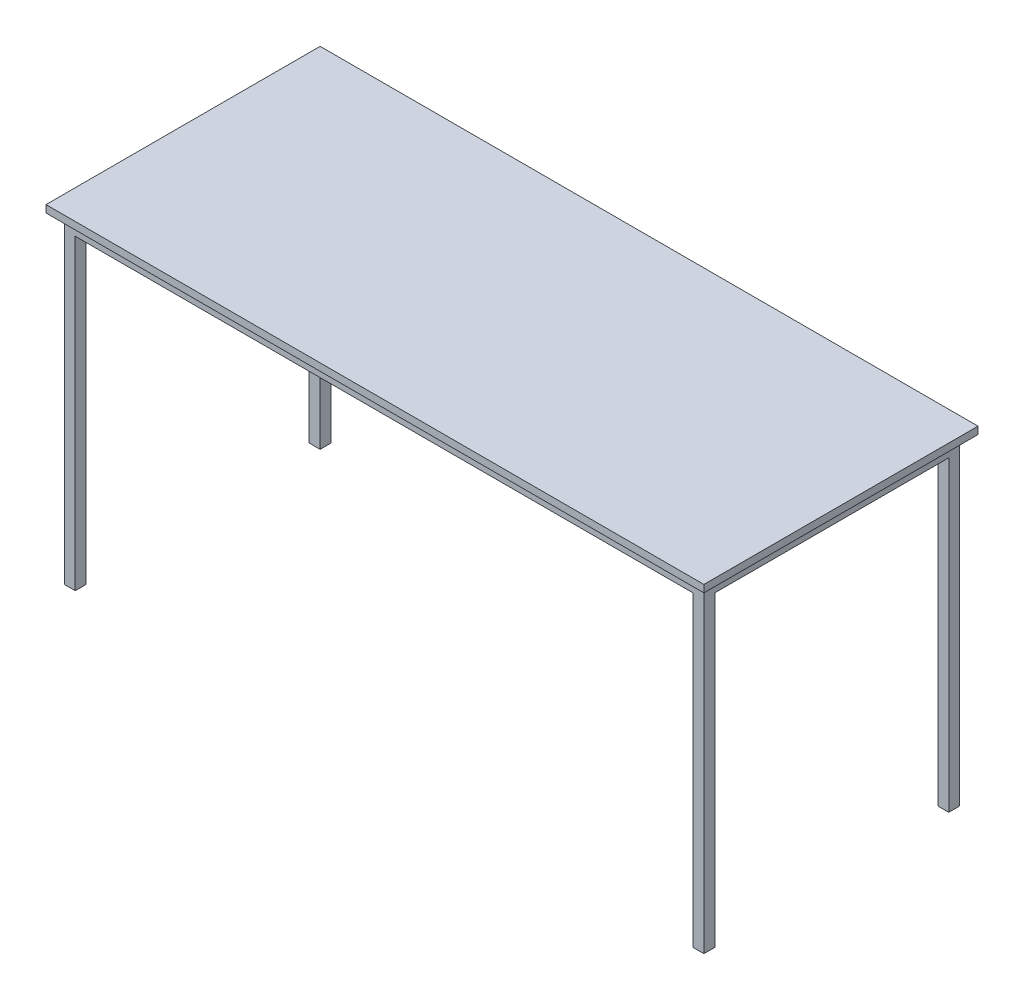
ISO-10303-21;
HEADER;
FILE_DESCRIPTION(('STEP AP214'),'2;1');
FILE_NAME('part.step','',(''),(''),'','','');
FILE_SCHEMA(('AUTOMOTIVE_DESIGN { 1 0 10303 214 1 1 1 1 }'));
ENDSEC;
DATA;
#1=APPLICATION_CONTEXT('core data for automotive mechanical design processes');
#2=APPLICATION_PROTOCOL_DEFINITION('international standard','automotive_design',2000,#1);
#3=PRODUCT_CONTEXT('',#1,'mechanical');
#4=PRODUCT('Part','Part','',(#3));
#5=PRODUCT_RELATED_PRODUCT_CATEGORY('part','',(#4));
#6=PRODUCT_DEFINITION_FORMATION('','',#4);
#7=PRODUCT_DEFINITION_CONTEXT('part definition',#1,'design');
#8=PRODUCT_DEFINITION('design','',#6,#7);
#9=PRODUCT_DEFINITION_SHAPE('','',#8);
#10=(LENGTH_UNIT() NAMED_UNIT(*) SI_UNIT(.MILLI.,.METRE.));
#11=(NAMED_UNIT(*) PLANE_ANGLE_UNIT() SI_UNIT($,.RADIAN.));
#12=(NAMED_UNIT(*) SI_UNIT($,.STERADIAN.) SOLID_ANGLE_UNIT());
#13=UNCERTAINTY_MEASURE_WITH_UNIT(LENGTH_MEASURE(1.E-05),#10,'distance_accuracy_value','');
#14=(GEOMETRIC_REPRESENTATION_CONTEXT(3) GLOBAL_UNCERTAINTY_ASSIGNED_CONTEXT((#13)) GLOBAL_UNIT_ASSIGNED_CONTEXT((#10,
#11,#12)) REPRESENTATION_CONTEXT('',''));
#15=CARTESIAN_POINT('',(0.,0.,0.));
#16=DIRECTION('',(0.,0.,1.));
#17=DIRECTION('',(1.,0.,0.));
#18=AXIS2_PLACEMENT_3D('',#15,#16,#17);
#19=CARTESIAN_POINT('',(-25.,20.,-725.));
#20=DIRECTION('',(1.,0.,0.));
#21=DIRECTION('',(0.,0.,-1.));
#22=AXIS2_PLACEMENT_3D('',#19,#20,#21);
#23=PLANE('',#22);
#24=DIRECTION('',(0.,0.,1.));
#25=VECTOR('',#24,1.);
#26=CARTESIAN_POINT('',(-25.,0.,-725.));
#27=LINE('',#26,#25);
#28=CARTESIAN_POINT('',(-25.,0.,-725.));
#29=VERTEX_POINT('',#28);
#30=CARTESIAN_POINT('',(-24.9999999999999,0.,25.0000000000001));
#31=VERTEX_POINT('',#30);
#32=EDGE_CURVE('E132',#29,#31,#27,.T.);
#33=ORIENTED_EDGE('',*,*,#32,.T.);
#34=DIRECTION('',(0.,-1.,0.));
#35=VECTOR('',#34,1.);
#36=CARTESIAN_POINT('',(-24.9999999999999,20.,25.0000000000001));
#37=LINE('',#36,#35);
#38=CARTESIAN_POINT('',(-24.9999999999999,20.,25.0000000000001));
#39=VERTEX_POINT('',#38);
#40=EDGE_CURVE('E13',#39,#31,#37,.T.);
#41=ORIENTED_EDGE('',*,*,#40,.F.);
#42=DIRECTION('',(0.,0.,1.));
#43=VECTOR('',#42,1.);
#44=CARTESIAN_POINT('',(-25.,20.,-725.));
#45=LINE('',#44,#43);
#46=CARTESIAN_POINT('',(-25.,20.,-725.));
#47=VERTEX_POINT('',#46);
#48=EDGE_CURVE('E120',#47,#39,#45,.T.);
#49=ORIENTED_EDGE('',*,*,#48,.F.);
#50=DIRECTION('',(0.,-1.,0.));
#51=VECTOR('',#50,1.);
#52=CARTESIAN_POINT('',(-25.,20.,-725.));
#53=LINE('',#52,#51);
#54=EDGE_CURVE('E128',#47,#29,#53,.T.);
#55=ORIENTED_EDGE('',*,*,#54,.T.);
#56=EDGE_LOOP('',(#33,#41,#49,#55));
#57=FACE_BOUND('',#56,.T.);
#58=ADVANCED_FACE('F69',(#57),#23,.F.);
#59=CARTESIAN_POINT('',(-24.9999999999999,20.,25.0000000000001));
#60=DIRECTION('',(0.,0.,-1.));
#61=DIRECTION('',(-1.,0.,0.));
#62=AXIS2_PLACEMENT_3D('',#59,#60,#61);
#63=PLANE('',#62);
#64=DIRECTION('',(1.,0.,0.));
#65=VECTOR('',#64,1.);
#66=CARTESIAN_POINT('',(-24.9999999999999,0.,25.0000000000001));
#67=LINE('',#66,#65);
#68=CARTESIAN_POINT('',(1775.,0.,25.0000000000001));
#69=VERTEX_POINT('',#68);
#70=EDGE_CURVE('E124',#31,#69,#67,.T.);
#71=ORIENTED_EDGE('',*,*,#70,.T.);
#72=DIRECTION('',(0.,-1.,0.));
#73=VECTOR('',#72,1.);
#74=CARTESIAN_POINT('',(1775.,20.,25.0000000000001));
#75=LINE('',#74,#73);
#76=CARTESIAN_POINT('',(1775.,20.,25.0000000000001));
#77=VERTEX_POINT('',#76);
#78=EDGE_CURVE('E77',#77,#69,#75,.T.);
#79=ORIENTED_EDGE('',*,*,#78,.F.);
#80=DIRECTION('',(1.,0.,0.));
#81=VECTOR('',#80,1.);
#82=CARTESIAN_POINT('',(-24.9999999999999,20.,25.0000000000001));
#83=LINE('',#82,#81);
#84=EDGE_CURVE('E115',#39,#77,#83,.T.);
#85=ORIENTED_EDGE('',*,*,#84,.F.);
#86=ORIENTED_EDGE('',*,*,#40,.T.);
#87=EDGE_LOOP('',(#71,#79,#85,#86));
#88=FACE_BOUND('',#87,.T.);
#89=ADVANCED_FACE('F123',(#88),#63,.F.);
#90=CARTESIAN_POINT('',(1775.,20.,-725.));
#91=DIRECTION('',(-1.,0.,0.));
#92=DIRECTION('',(0.,0.,1.));
#93=AXIS2_PLACEMENT_3D('',#90,#91,#92);
#94=PLANE('',#93);
#95=DIRECTION('',(0.,0.,-1.));
#96=VECTOR('',#95,1.);
#97=CARTESIAN_POINT('',(1775.,0.,-725.));
#98=LINE('',#97,#96);
#99=CARTESIAN_POINT('',(1775.,0.,-725.));
#100=VERTEX_POINT('',#99);
#101=EDGE_CURVE('E102',#69,#100,#98,.T.);
#102=ORIENTED_EDGE('',*,*,#101,.T.);
#103=DIRECTION('',(0.,-1.,0.));
#104=VECTOR('',#103,1.);
#105=CARTESIAN_POINT('',(1775.,20.,-725.));
#106=LINE('',#105,#104);
#107=CARTESIAN_POINT('',(1775.,20.,-725.));
#108=VERTEX_POINT('',#107);
#109=EDGE_CURVE('E125',#108,#100,#106,.T.);
#110=ORIENTED_EDGE('',*,*,#109,.F.);
#111=DIRECTION('',(0.,0.,-1.));
#112=VECTOR('',#111,1.);
#113=CARTESIAN_POINT('',(1775.,20.,-725.));
#114=LINE('',#113,#112);
#115=EDGE_CURVE('E118',#77,#108,#114,.T.);
#116=ORIENTED_EDGE('',*,*,#115,.F.);
#117=ORIENTED_EDGE('',*,*,#78,.T.);
#118=EDGE_LOOP('',(#102,#110,#116,#117));
#119=FACE_BOUND('',#118,.T.);
#120=ADVANCED_FACE('F126',(#119),#94,.F.);
#121=CARTESIAN_POINT('',(-25.,20.,-725.));
#122=DIRECTION('',(0.,0.,1.));
#123=DIRECTION('',(1.,0.,0.));
#124=AXIS2_PLACEMENT_3D('',#121,#122,#123);
#125=PLANE('',#124);
#126=DIRECTION('',(-1.,0.,0.));
#127=VECTOR('',#126,1.);
#128=CARTESIAN_POINT('',(-25.,0.,-725.));
#129=LINE('',#128,#127);
#130=EDGE_CURVE('E108',#100,#29,#129,.T.);
#131=ORIENTED_EDGE('',*,*,#130,.T.);
#132=ORIENTED_EDGE('',*,*,#54,.F.);
#133=DIRECTION('',(-1.,0.,0.));
#134=VECTOR('',#133,1.);
#135=CARTESIAN_POINT('',(-25.,20.,-725.));
#136=LINE('',#135,#134);
#137=EDGE_CURVE('E85',#108,#47,#136,.T.);
#138=ORIENTED_EDGE('',*,*,#137,.F.);
#139=ORIENTED_EDGE('',*,*,#109,.T.);
#140=EDGE_LOOP('',(#131,#132,#138,#139));
#141=FACE_BOUND('',#140,.T.);
#142=ADVANCED_FACE('F139',(#141),#125,.F.);
#143=CARTESIAN_POINT('',(0.,20.,0.));
#144=DIRECTION('',(0.,1.,0.));
#145=DIRECTION('',(0.,0.,1.));
#146=AXIS2_PLACEMENT_3D('',#143,#144,#145);
#147=PLANE('',#146);
#148=ORIENTED_EDGE('',*,*,#48,.T.);
#149=ORIENTED_EDGE('',*,*,#84,.T.);
#150=ORIENTED_EDGE('',*,*,#115,.T.);
#151=ORIENTED_EDGE('',*,*,#137,.T.);
#152=EDGE_LOOP('',(#148,#149,#150,#151));
#153=FACE_BOUND('',#152,.T.);
#154=ADVANCED_FACE('F116',(#153),#147,.T.);
#155=CARTESIAN_POINT('',(0.,0.,0.));
#156=DIRECTION('',(0.,1.,0.));
#157=DIRECTION('',(0.,0.,1.));
#158=AXIS2_PLACEMENT_3D('',#155,#156,#157);
#159=PLANE('',#158);
#160=ORIENTED_EDGE('',*,*,#32,.F.);
#161=ORIENTED_EDGE('',*,*,#130,.F.);
#162=ORIENTED_EDGE('',*,*,#101,.F.);
#163=ORIENTED_EDGE('',*,*,#70,.F.);
#164=EDGE_LOOP('',(#160,#161,#162,#163));
#165=FACE_BOUND('',#164,.T.);
#166=ADVANCED_FACE('F142',(#165),#159,.F.);
#167=CLOSED_SHELL('',(#58,#89,#120,#142,#154,#166));
#168=MANIFOLD_SOLID_BREP('B2',#167);
#169=CARTESIAN_POINT('',(0.,-40.,0.));
#170=DIRECTION('',(0.,1.,0.));
#171=DIRECTION('',(0.,0.,1.));
#172=AXIS2_PLACEMENT_3D('',#169,#170,#171);
#173=PLANE('',#172);
#174=DIRECTION('',(0.,0.,-1.));
#175=VECTOR('',#174,1.);
#176=CARTESIAN_POINT('',(1720.,-40.,0.));
#177=LINE('',#176,#175);
#178=CARTESIAN_POINT('',(1720.,-40.,-30.));
#179=VERTEX_POINT('',#178);
#180=CARTESIAN_POINT('',(1720.,-40.,-670.));
#181=VERTEX_POINT('',#180);
#182=EDGE_CURVE('E450',#179,#181,#177,.T.);
#183=ORIENTED_EDGE('',*,*,#182,.T.);
#184=DIRECTION('',(1.,0.,0.));
#185=VECTOR('',#184,1.);
#186=CARTESIAN_POINT('',(0.,-40.,-670.));
#187=LINE('',#186,#185);
#188=CARTESIAN_POINT('',(1750.,-40.,-670.));
#189=VERTEX_POINT('',#188);
#190=EDGE_CURVE('E358',#181,#189,#187,.T.);
#191=ORIENTED_EDGE('',*,*,#190,.T.);
#192=DIRECTION('',(0.,0.,-1.));
#193=VECTOR('',#192,1.);
#194=CARTESIAN_POINT('',(1750.,-40.,0.));
#195=LINE('',#194,#193);
#196=CARTESIAN_POINT('',(1750.,-40.,-30.));
#197=VERTEX_POINT('',#196);
#198=EDGE_CURVE('E480',#197,#189,#195,.T.);
#199=ORIENTED_EDGE('',*,*,#198,.F.);
#200=DIRECTION('',(-1.,0.,0.));
#201=VECTOR('',#200,1.);
#202=CARTESIAN_POINT('',(0.,-40.,-30.));
#203=LINE('',#202,#201);
#204=EDGE_CURVE('E390',#197,#179,#203,.T.);
#205=ORIENTED_EDGE('',*,*,#204,.T.);
#206=EDGE_LOOP('',(#183,#191,#199,#205));
#207=FACE_BOUND('',#206,.T.);
#208=ADVANCED_FACE('F203',(#207),#173,.F.);
#209=DIRECTION('',(1.,0.,0.));
#210=VECTOR('',#209,1.);
#211=CARTESIAN_POINT('',(0.,-40.,-30.));
#212=LINE('',#211,#210);
#213=CARTESIAN_POINT('',(30.,-40.,-30.));
#214=VERTEX_POINT('',#213);
#215=EDGE_CURVE('E446',#214,#179,#212,.T.);
#216=ORIENTED_EDGE('',*,*,#215,.T.);
#217=DIRECTION('',(0.,0.,1.));
#218=VECTOR('',#217,1.);
#219=CARTESIAN_POINT('',(1720.,-40.,0.));
#220=LINE('',#219,#218);
#221=CARTESIAN_POINT('',(1720.,-40.,0.));
#222=VERTEX_POINT('',#221);
#223=EDGE_CURVE('E383',#179,#222,#220,.T.);
#224=ORIENTED_EDGE('',*,*,#223,.T.);
#225=DIRECTION('',(1.,0.,0.));
#226=VECTOR('',#225,1.);
#227=CARTESIAN_POINT('',(0.,-40.,0.));
#228=LINE('',#227,#226);
#229=CARTESIAN_POINT('',(30.,-40.,0.));
#230=VERTEX_POINT('',#229);
#231=EDGE_CURVE('E478',#230,#222,#228,.T.);
#232=ORIENTED_EDGE('',*,*,#231,.F.);
#233=DIRECTION('',(0.,0.,-1.));
#234=VECTOR('',#233,1.);
#235=CARTESIAN_POINT('',(30.,-40.,0.));
#236=LINE('',#235,#234);
#237=EDGE_CURVE('E406',#230,#214,#236,.T.);
#238=ORIENTED_EDGE('',*,*,#237,.T.);
#239=EDGE_LOOP('',(#216,#224,#232,#238));
#240=FACE_BOUND('',#239,.T.);
#241=ADVANCED_FACE('F523',(#240),#173,.F.);
#242=DIRECTION('',(0.,0.,1.));
#243=VECTOR('',#242,1.);
#244=CARTESIAN_POINT('',(30.,-40.,0.));
#245=LINE('',#244,#243);
#246=CARTESIAN_POINT('',(30.,-40.,-670.));
#247=VERTEX_POINT('',#246);
#248=EDGE_CURVE('E443',#247,#214,#245,.T.);
#249=ORIENTED_EDGE('',*,*,#248,.T.);
#250=DIRECTION('',(-1.,0.,0.));
#251=VECTOR('',#250,1.);
#252=CARTESIAN_POINT('',(0.,-40.,-30.));
#253=LINE('',#252,#251);
#254=CARTESIAN_POINT('',(0.,-40.,-30.));
#255=VERTEX_POINT('',#254);
#256=EDGE_CURVE('E413',#214,#255,#253,.T.);
#257=ORIENTED_EDGE('',*,*,#256,.T.);
#258=DIRECTION('',(0.,0.,1.));
#259=VECTOR('',#258,1.);
#260=CARTESIAN_POINT('',(0.,-40.,0.));
#261=LINE('',#260,#259);
#262=CARTESIAN_POINT('',(0.,-40.,-670.));
#263=VERTEX_POINT('',#262);
#264=EDGE_CURVE('E475',#263,#255,#261,.T.);
#265=ORIENTED_EDGE('',*,*,#264,.F.);
#266=DIRECTION('',(1.,0.,0.));
#267=VECTOR('',#266,1.);
#268=CARTESIAN_POINT('',(0.,-40.,-670.));
#269=LINE('',#268,#267);
#270=EDGE_CURVE('E439',#263,#247,#269,.T.);
#271=ORIENTED_EDGE('',*,*,#270,.T.);
#272=EDGE_LOOP('',(#249,#257,#265,#271));
#273=FACE_BOUND('',#272,.T.);
#274=ADVANCED_FACE('F511',(#273),#173,.F.);
#275=CARTESIAN_POINT('',(0.,-40.,0.));
#276=DIRECTION('',(-1.,0.,0.));
#277=DIRECTION('',(0.,0.,1.));
#278=AXIS2_PLACEMENT_3D('',#275,#276,#277);
#279=PLANE('',#278);
#280=ORIENTED_EDGE('',*,*,#264,.T.);
#281=DIRECTION('',(0.,1.,0.));
#282=VECTOR('',#281,1.);
#283=CARTESIAN_POINT('',(0.,-880.,-30.));
#284=LINE('',#283,#282);
#285=CARTESIAN_POINT('',(0.,-880.,-30.));
#286=VERTEX_POINT('',#285);
#287=EDGE_CURVE('E404',#286,#255,#284,.T.);
#288=ORIENTED_EDGE('',*,*,#287,.F.);
#289=DIRECTION('',(0.,0.,1.));
#290=VECTOR('',#289,1.);
#291=CARTESIAN_POINT('',(0.,-880.,0.));
#292=LINE('',#291,#290);
#293=CARTESIAN_POINT('',(0.,-880.,0.));
#294=VERTEX_POINT('',#293);
#295=EDGE_CURVE('E393',#286,#294,#292,.T.);
#296=ORIENTED_EDGE('',*,*,#295,.T.);
#297=DIRECTION('',(0.,1.,0.));
#298=VECTOR('',#297,1.);
#299=CARTESIAN_POINT('',(0.,-40.,0.));
#300=LINE('',#299,#298);
#301=CARTESIAN_POINT('',(0.,0.,0.));
#302=VERTEX_POINT('',#301);
#303=EDGE_CURVE('E207',#294,#302,#300,.T.);
#304=ORIENTED_EDGE('',*,*,#303,.T.);
#305=DIRECTION('',(0.,0.,1.));
#306=VECTOR('',#305,1.);
#307=CARTESIAN_POINT('',(0.,0.,0.));
#308=LINE('',#307,#306);
#309=CARTESIAN_POINT('',(0.,0.,-700.));
#310=VERTEX_POINT('',#309);
#311=EDGE_CURVE('E468',#310,#302,#308,.T.);
#312=ORIENTED_EDGE('',*,*,#311,.F.);
#313=DIRECTION('',(0.,1.,0.));
#314=VECTOR('',#313,1.);
#315=CARTESIAN_POINT('',(0.,-40.,-700.));
#316=LINE('',#315,#314);
#317=CARTESIAN_POINT('',(0.,-880.,-700.));
#318=VERTEX_POINT('',#317);
#319=EDGE_CURVE('E67',#318,#310,#316,.T.);
#320=ORIENTED_EDGE('',*,*,#319,.F.);
#321=DIRECTION('',(0.,0.,1.));
#322=VECTOR('',#321,1.);
#323=CARTESIAN_POINT('',(0.,-880.,-700.));
#324=LINE('',#323,#322);
#325=CARTESIAN_POINT('',(0.,-880.,-670.));
#326=VERTEX_POINT('',#325);
#327=EDGE_CURVE('E416',#318,#326,#324,.T.);
#328=ORIENTED_EDGE('',*,*,#327,.T.);
#329=DIRECTION('',(0.,1.,0.));
#330=VECTOR('',#329,1.);
#331=CARTESIAN_POINT('',(0.,-880.,-670.));
#332=LINE('',#331,#330);
#333=EDGE_CURVE('E428',#326,#263,#332,.T.);
#334=ORIENTED_EDGE('',*,*,#333,.T.);
#335=EDGE_LOOP('',(#280,#288,#296,#304,#312,#320,#328,#334));
#336=FACE_BOUND('',#335,.T.);
#337=ADVANCED_FACE('F205',(#336),#279,.T.);
#338=CARTESIAN_POINT('',(0.,-40.,-700.));
#339=DIRECTION('',(0.,0.,-1.));
#340=DIRECTION('',(-1.,0.,0.));
#341=AXIS2_PLACEMENT_3D('',#338,#339,#340);
#342=PLANE('',#341);
#343=ORIENTED_EDGE('',*,*,#319,.T.);
#344=DIRECTION('',(-1.,0.,0.));
#345=VECTOR('',#344,1.);
#346=CARTESIAN_POINT('',(0.,0.,-700.));
#347=LINE('',#346,#345);
#348=CARTESIAN_POINT('',(1750.,0.,-700.));
#349=VERTEX_POINT('',#348);
#350=EDGE_CURVE('E333',#349,#310,#347,.T.);
#351=ORIENTED_EDGE('',*,*,#350,.F.);
#352=DIRECTION('',(0.,1.,0.));
#353=VECTOR('',#352,1.);
#354=CARTESIAN_POINT('',(1750.,-40.,-700.));
#355=LINE('',#354,#353);
#356=CARTESIAN_POINT('',(1750.,-880.,-700.));
#357=VERTEX_POINT('',#356);
#358=EDGE_CURVE('E212',#357,#349,#355,.T.);
#359=ORIENTED_EDGE('',*,*,#358,.F.);
#360=DIRECTION('',(-1.,0.,0.));
#361=VECTOR('',#360,1.);
#362=CARTESIAN_POINT('',(1750.,-880.,-700.));
#363=LINE('',#362,#361);
#364=CARTESIAN_POINT('',(1720.,-880.,-700.));
#365=VERTEX_POINT('',#364);
#366=EDGE_CURVE('E332',#357,#365,#363,.T.);
#367=ORIENTED_EDGE('',*,*,#366,.T.);
#368=DIRECTION('',(0.,1.,0.));
#369=VECTOR('',#368,1.);
#370=CARTESIAN_POINT('',(1720.,-880.,-700.));
#371=LINE('',#370,#369);
#372=CARTESIAN_POINT('',(1720.,-40.,-700.));
#373=VERTEX_POINT('',#372);
#374=EDGE_CURVE('E220',#365,#373,#371,.T.);
#375=ORIENTED_EDGE('',*,*,#374,.T.);
#376=DIRECTION('',(-1.,0.,0.));
#377=VECTOR('',#376,1.);
#378=CARTESIAN_POINT('',(0.,-40.,-700.));
#379=LINE('',#378,#377);
#380=CARTESIAN_POINT('',(30.,-40.,-700.));
#381=VERTEX_POINT('',#380);
#382=EDGE_CURVE('E482',#373,#381,#379,.T.);
#383=ORIENTED_EDGE('',*,*,#382,.T.);
#384=DIRECTION('',(0.,1.,0.));
#385=VECTOR('',#384,1.);
#386=CARTESIAN_POINT('',(30.,-880.,-700.));
#387=LINE('',#386,#385);
#388=CARTESIAN_POINT('',(30.,-880.,-700.));
#389=VERTEX_POINT('',#388);
#390=EDGE_CURVE('E429',#389,#381,#387,.T.);
#391=ORIENTED_EDGE('',*,*,#390,.F.);
#392=DIRECTION('',(-1.,0.,0.));
#393=VECTOR('',#392,1.);
#394=CARTESIAN_POINT('',(0.,-880.,-700.));
#395=LINE('',#394,#393);
#396=EDGE_CURVE('E425',#389,#318,#395,.T.);
#397=ORIENTED_EDGE('',*,*,#396,.T.);
#398=EDGE_LOOP('',(#343,#351,#359,#367,#375,#383,#391,#397));
#399=FACE_BOUND('',#398,.T.);
#400=ADVANCED_FACE('F331',(#399),#342,.T.);
#401=CARTESIAN_POINT('',(1750.,-40.,0.));
#402=DIRECTION('',(1.,0.,0.));
#403=DIRECTION('',(0.,0.,-1.));
#404=AXIS2_PLACEMENT_3D('',#401,#402,#403);
#405=PLANE('',#404);
#406=ORIENTED_EDGE('',*,*,#198,.T.);
#407=DIRECTION('',(0.,1.,0.));
#408=VECTOR('',#407,1.);
#409=CARTESIAN_POINT('',(1750.,-880.,-670.));
#410=LINE('',#409,#408);
#411=CARTESIAN_POINT('',(1750.,-880.,-670.));
#412=VERTEX_POINT('',#411);
#413=EDGE_CURVE('E351',#412,#189,#410,.T.);
#414=ORIENTED_EDGE('',*,*,#413,.F.);
#415=DIRECTION('',(0.,0.,-1.));
#416=VECTOR('',#415,1.);
#417=CARTESIAN_POINT('',(1750.,-880.,-700.));
#418=LINE('',#417,#416);
#419=EDGE_CURVE('E344',#412,#357,#418,.T.);
#420=ORIENTED_EDGE('',*,*,#419,.T.);
#421=ORIENTED_EDGE('',*,*,#358,.T.);
#422=DIRECTION('',(0.,0.,-1.));
#423=VECTOR('',#422,1.);
#424=CARTESIAN_POINT('',(1750.,0.,0.));
#425=LINE('',#424,#423);
#426=CARTESIAN_POINT('',(1750.,0.,0.));
#427=VERTEX_POINT('',#426);
#428=EDGE_CURVE('E487',#427,#349,#425,.T.);
#429=ORIENTED_EDGE('',*,*,#428,.F.);
#430=DIRECTION('',(0.,1.,0.));
#431=VECTOR('',#430,1.);
#432=CARTESIAN_POINT('',(1750.,-40.,0.));
#433=LINE('',#432,#431);
#434=CARTESIAN_POINT('',(1750.,-880.,0.));
#435=VERTEX_POINT('',#434);
#436=EDGE_CURVE('E337',#435,#427,#433,.T.);
#437=ORIENTED_EDGE('',*,*,#436,.F.);
#438=DIRECTION('',(0.,0.,-1.));
#439=VECTOR('',#438,1.);
#440=CARTESIAN_POINT('',(1750.,-880.,0.));
#441=LINE('',#440,#439);
#442=CARTESIAN_POINT('',(1750.,-880.,-30.));
#443=VERTEX_POINT('',#442);
#444=EDGE_CURVE('E368',#435,#443,#441,.T.);
#445=ORIENTED_EDGE('',*,*,#444,.T.);
#446=DIRECTION('',(0.,1.,0.));
#447=VECTOR('',#446,1.);
#448=CARTESIAN_POINT('',(1750.,-880.,-30.));
#449=LINE('',#448,#447);
#450=EDGE_CURVE('E380',#443,#197,#449,.T.);
#451=ORIENTED_EDGE('',*,*,#450,.T.);
#452=EDGE_LOOP('',(#406,#414,#420,#421,#429,#437,#445,#451));
#453=FACE_BOUND('',#452,.T.);
#454=ADVANCED_FACE('F350',(#453),#405,.T.);
#455=CARTESIAN_POINT('',(0.,-40.,0.));
#456=DIRECTION('',(0.,0.,1.));
#457=DIRECTION('',(1.,0.,0.));
#458=AXIS2_PLACEMENT_3D('',#455,#456,#457);
#459=PLANE('',#458);
#460=ORIENTED_EDGE('',*,*,#231,.T.);
#461=DIRECTION('',(0.,1.,0.));
#462=VECTOR('',#461,1.);
#463=CARTESIAN_POINT('',(1720.,-880.,0.));
#464=LINE('',#463,#462);
#465=CARTESIAN_POINT('',(1720.,-880.,0.));
#466=VERTEX_POINT('',#465);
#467=EDGE_CURVE('E381',#466,#222,#464,.T.);
#468=ORIENTED_EDGE('',*,*,#467,.F.);
#469=DIRECTION('',(1.,0.,0.));
#470=VECTOR('',#469,1.);
#471=CARTESIAN_POINT('',(1750.,-880.,0.));
#472=LINE('',#471,#470);
#473=EDGE_CURVE('E377',#466,#435,#472,.T.);
#474=ORIENTED_EDGE('',*,*,#473,.T.);
#475=ORIENTED_EDGE('',*,*,#436,.T.);
#476=DIRECTION('',(1.,0.,0.));
#477=VECTOR('',#476,1.);
#478=CARTESIAN_POINT('',(0.,0.,0.));
#479=LINE('',#478,#477);
#480=EDGE_CURVE('E485',#302,#427,#479,.T.);
#481=ORIENTED_EDGE('',*,*,#480,.F.);
#482=ORIENTED_EDGE('',*,*,#303,.F.);
#483=DIRECTION('',(1.,0.,0.));
#484=VECTOR('',#483,1.);
#485=CARTESIAN_POINT('',(0.,-880.,0.));
#486=LINE('',#485,#484);
#487=CARTESIAN_POINT('',(30.,-880.,0.));
#488=VERTEX_POINT('',#487);
#489=EDGE_CURVE('E396',#294,#488,#486,.T.);
#490=ORIENTED_EDGE('',*,*,#489,.T.);
#491=DIRECTION('',(0.,1.,0.));
#492=VECTOR('',#491,1.);
#493=CARTESIAN_POINT('',(30.,-880.,0.));
#494=LINE('',#493,#492);
#495=EDGE_CURVE('E228',#488,#230,#494,.T.);
#496=ORIENTED_EDGE('',*,*,#495,.T.);
#497=EDGE_LOOP('',(#460,#468,#474,#475,#481,#482,#490,#496));
#498=FACE_BOUND('',#497,.T.);
#499=ADVANCED_FACE('F496',(#498),#459,.T.);
#500=ORIENTED_EDGE('',*,*,#382,.F.);
#501=DIRECTION('',(0.,0.,1.));
#502=VECTOR('',#501,1.);
#503=CARTESIAN_POINT('',(1720.,-40.,0.));
#504=LINE('',#503,#502);
#505=EDGE_CURVE('E365',#373,#181,#504,.T.);
#506=ORIENTED_EDGE('',*,*,#505,.T.);
#507=DIRECTION('',(-1.,0.,0.));
#508=VECTOR('',#507,1.);
#509=CARTESIAN_POINT('',(0.,-40.,-670.));
#510=LINE('',#509,#508);
#511=EDGE_CURVE('E453',#181,#247,#510,.T.);
#512=ORIENTED_EDGE('',*,*,#511,.T.);
#513=DIRECTION('',(0.,0.,-1.));
#514=VECTOR('',#513,1.);
#515=CARTESIAN_POINT('',(30.,-40.,0.));
#516=LINE('',#515,#514);
#517=EDGE_CURVE('E432',#247,#381,#516,.T.);
#518=ORIENTED_EDGE('',*,*,#517,.T.);
#519=EDGE_LOOP('',(#500,#506,#512,#518));
#520=FACE_BOUND('',#519,.T.);
#521=ADVANCED_FACE('F564',(#520),#173,.F.);
#522=CARTESIAN_POINT('',(0.,0.,0.));
#523=DIRECTION('',(0.,1.,0.));
#524=DIRECTION('',(0.,0.,1.));
#525=AXIS2_PLACEMENT_3D('',#522,#523,#524);
#526=PLANE('',#525);
#527=ORIENTED_EDGE('',*,*,#428,.T.);
#528=ORIENTED_EDGE('',*,*,#350,.T.);
#529=ORIENTED_EDGE('',*,*,#311,.T.);
#530=ORIENTED_EDGE('',*,*,#480,.T.);
#531=EDGE_LOOP('',(#527,#528,#529,#530));
#532=FACE_BOUND('',#531,.T.);
#533=DIRECTION('',(-1.,0.,0.));
#534=VECTOR('',#533,1.);
#535=CARTESIAN_POINT('',(0.,0.,-670.));
#536=LINE('',#535,#534);
#537=CARTESIAN_POINT('',(1720.,0.,-670.));
#538=VERTEX_POINT('',#537);
#539=CARTESIAN_POINT('',(30.,0.,-670.));
#540=VERTEX_POINT('',#539);
#541=EDGE_CURVE('E447',#538,#540,#536,.T.);
#542=ORIENTED_EDGE('',*,*,#541,.F.);
#543=DIRECTION('',(0.,0.,-1.));
#544=VECTOR('',#543,1.);
#545=CARTESIAN_POINT('',(1720.,0.,0.));
#546=LINE('',#545,#544);
#547=CARTESIAN_POINT('',(1720.,0.,-30.));
#548=VERTEX_POINT('',#547);
#549=EDGE_CURVE('E461',#548,#538,#546,.T.);
#550=ORIENTED_EDGE('',*,*,#549,.F.);
#551=DIRECTION('',(1.,0.,0.));
#552=VECTOR('',#551,1.);
#553=CARTESIAN_POINT('',(0.,0.,-30.));
#554=LINE('',#553,#552);
#555=CARTESIAN_POINT('',(30.,0.,-30.));
#556=VERTEX_POINT('',#555);
#557=EDGE_CURVE('E458',#556,#548,#554,.T.);
#558=ORIENTED_EDGE('',*,*,#557,.F.);
#559=DIRECTION('',(0.,0.,1.));
#560=VECTOR('',#559,1.);
#561=CARTESIAN_POINT('',(30.,0.,0.));
#562=LINE('',#561,#560);
#563=EDGE_CURVE('E442',#540,#556,#562,.T.);
#564=ORIENTED_EDGE('',*,*,#563,.F.);
#565=EDGE_LOOP('',(#542,#550,#558,#564));
#566=FACE_BOUND('',#565,.T.);
#567=ADVANCED_FACE('F498',(#532,#566),#526,.T.);
#568=CARTESIAN_POINT('',(30.,-40.,0.));
#569=DIRECTION('',(-1.,0.,0.));
#570=DIRECTION('',(0.,0.,1.));
#571=AXIS2_PLACEMENT_3D('',#568,#569,#570);
#572=PLANE('',#571);
#573=ORIENTED_EDGE('',*,*,#563,.T.);
#574=DIRECTION('',(0.,1.,0.));
#575=VECTOR('',#574,1.);
#576=CARTESIAN_POINT('',(30.,-40.,-30.));
#577=LINE('',#576,#575);
#578=EDGE_CURVE('E456',#214,#556,#577,.T.);
#579=ORIENTED_EDGE('',*,*,#578,.F.);
#580=ORIENTED_EDGE('',*,*,#248,.F.);
#581=DIRECTION('',(0.,1.,0.));
#582=VECTOR('',#581,1.);
#583=CARTESIAN_POINT('',(30.,-40.,-670.));
#584=LINE('',#583,#582);
#585=EDGE_CURVE('E466',#247,#540,#584,.T.);
#586=ORIENTED_EDGE('',*,*,#585,.T.);
#587=EDGE_LOOP('',(#573,#579,#580,#586));
#588=FACE_BOUND('',#587,.T.);
#589=ADVANCED_FACE('F526',(#588),#572,.F.);
#590=CARTESIAN_POINT('',(0.,-40.,-670.));
#591=DIRECTION('',(0.,0.,-1.));
#592=DIRECTION('',(-1.,0.,0.));
#593=AXIS2_PLACEMENT_3D('',#590,#591,#592);
#594=PLANE('',#593);
#595=ORIENTED_EDGE('',*,*,#541,.T.);
#596=ORIENTED_EDGE('',*,*,#585,.F.);
#597=ORIENTED_EDGE('',*,*,#511,.F.);
#598=DIRECTION('',(0.,1.,0.));
#599=VECTOR('',#598,1.);
#600=CARTESIAN_POINT('',(1720.,-40.,-670.));
#601=LINE('',#600,#599);
#602=EDGE_CURVE('E469',#181,#538,#601,.T.);
#603=ORIENTED_EDGE('',*,*,#602,.T.);
#604=EDGE_LOOP('',(#595,#596,#597,#603));
#605=FACE_BOUND('',#604,.T.);
#606=ADVANCED_FACE('F617',(#605),#594,.F.);
#607=CARTESIAN_POINT('',(1720.,-40.,0.));
#608=DIRECTION('',(1.,0.,0.));
#609=DIRECTION('',(0.,0.,-1.));
#610=AXIS2_PLACEMENT_3D('',#607,#608,#609);
#611=PLANE('',#610);
#612=ORIENTED_EDGE('',*,*,#549,.T.);
#613=ORIENTED_EDGE('',*,*,#602,.F.);
#614=ORIENTED_EDGE('',*,*,#182,.F.);
#615=DIRECTION('',(0.,1.,0.));
#616=VECTOR('',#615,1.);
#617=CARTESIAN_POINT('',(1720.,-40.,-30.));
#618=LINE('',#617,#616);
#619=EDGE_CURVE('E471',#179,#548,#618,.T.);
#620=ORIENTED_EDGE('',*,*,#619,.T.);
#621=EDGE_LOOP('',(#612,#613,#614,#620));
#622=FACE_BOUND('',#621,.T.);
#623=ADVANCED_FACE('F535',(#622),#611,.F.);
#624=CARTESIAN_POINT('',(0.,-40.,-30.));
#625=DIRECTION('',(0.,0.,1.));
#626=DIRECTION('',(1.,0.,0.));
#627=AXIS2_PLACEMENT_3D('',#624,#625,#626);
#628=PLANE('',#627);
#629=ORIENTED_EDGE('',*,*,#557,.T.);
#630=ORIENTED_EDGE('',*,*,#619,.F.);
#631=ORIENTED_EDGE('',*,*,#215,.F.);
#632=ORIENTED_EDGE('',*,*,#578,.T.);
#633=EDGE_LOOP('',(#629,#630,#631,#632));
#634=FACE_BOUND('',#633,.T.);
#635=ADVANCED_FACE('F531',(#634),#628,.F.);
#636=CARTESIAN_POINT('',(0.,-880.,-670.));
#637=DIRECTION('',(0.,0.,1.));
#638=DIRECTION('',(1.,0.,0.));
#639=AXIS2_PLACEMENT_3D('',#636,#637,#638);
#640=PLANE('',#639);
#641=ORIENTED_EDGE('',*,*,#270,.F.);
#642=ORIENTED_EDGE('',*,*,#333,.F.);
#643=DIRECTION('',(1.,0.,0.));
#644=VECTOR('',#643,1.);
#645=CARTESIAN_POINT('',(0.,-880.,-670.));
#646=LINE('',#645,#644);
#647=CARTESIAN_POINT('',(30.,-880.,-670.));
#648=VERTEX_POINT('',#647);
#649=EDGE_CURVE('E419',#326,#648,#646,.T.);
#650=ORIENTED_EDGE('',*,*,#649,.T.);
#651=DIRECTION('',(0.,1.,0.));
#652=VECTOR('',#651,1.);
#653=CARTESIAN_POINT('',(30.,-880.,-670.));
#654=LINE('',#653,#652);
#655=EDGE_CURVE('E433',#648,#247,#654,.T.);
#656=ORIENTED_EDGE('',*,*,#655,.T.);
#657=EDGE_LOOP('',(#641,#642,#650,#656));
#658=FACE_BOUND('',#657,.T.);
#659=ADVANCED_FACE('F507',(#658),#640,.T.);
#660=CARTESIAN_POINT('',(30.,-880.,-700.));
#661=DIRECTION('',(1.,0.,0.));
#662=DIRECTION('',(0.,0.,-1.));
#663=AXIS2_PLACEMENT_3D('',#660,#661,#662);
#664=PLANE('',#663);
#665=ORIENTED_EDGE('',*,*,#517,.F.);
#666=ORIENTED_EDGE('',*,*,#655,.F.);
#667=DIRECTION('',(0.,0.,-1.));
#668=VECTOR('',#667,1.);
#669=CARTESIAN_POINT('',(30.,-880.,-700.));
#670=LINE('',#669,#668);
#671=EDGE_CURVE('E422',#648,#389,#670,.T.);
#672=ORIENTED_EDGE('',*,*,#671,.T.);
#673=ORIENTED_EDGE('',*,*,#390,.T.);
#674=EDGE_LOOP('',(#665,#666,#672,#673));
#675=FACE_BOUND('',#674,.T.);
#676=ADVANCED_FACE('F650',(#675),#664,.T.);
#677=CARTESIAN_POINT('',(0.,-880.,0.));
#678=DIRECTION('',(0.,1.,0.));
#679=DIRECTION('',(0.,0.,1.));
#680=AXIS2_PLACEMENT_3D('',#677,#678,#679);
#681=PLANE('',#680);
#682=ORIENTED_EDGE('',*,*,#327,.F.);
#683=ORIENTED_EDGE('',*,*,#396,.F.);
#684=ORIENTED_EDGE('',*,*,#671,.F.);
#685=ORIENTED_EDGE('',*,*,#649,.F.);
#686=EDGE_LOOP('',(#682,#683,#684,#685));
#687=FACE_BOUND('',#686,.T.);
#688=ADVANCED_FACE('F504',(#687),#681,.F.);
#689=CARTESIAN_POINT('',(0.,-880.,-30.));
#690=DIRECTION('',(0.,0.,-1.));
#691=DIRECTION('',(-1.,0.,0.));
#692=AXIS2_PLACEMENT_3D('',#689,#690,#691);
#693=PLANE('',#692);
#694=ORIENTED_EDGE('',*,*,#256,.F.);
#695=DIRECTION('',(0.,1.,0.));
#696=VECTOR('',#695,1.);
#697=CARTESIAN_POINT('',(30.,-880.,-30.));
#698=LINE('',#697,#696);
#699=CARTESIAN_POINT('',(30.,-880.,-30.));
#700=VERTEX_POINT('',#699);
#701=EDGE_CURVE('E407',#700,#214,#698,.T.);
#702=ORIENTED_EDGE('',*,*,#701,.F.);
#703=DIRECTION('',(-1.,0.,0.));
#704=VECTOR('',#703,1.);
#705=CARTESIAN_POINT('',(0.,-880.,-30.));
#706=LINE('',#705,#704);
#707=EDGE_CURVE('E401',#700,#286,#706,.T.);
#708=ORIENTED_EDGE('',*,*,#707,.T.);
#709=ORIENTED_EDGE('',*,*,#287,.T.);
#710=EDGE_LOOP('',(#694,#702,#708,#709));
#711=FACE_BOUND('',#710,.T.);
#712=ADVANCED_FACE('F515',(#711),#693,.T.);
#713=CARTESIAN_POINT('',(30.,-880.,0.));
#714=DIRECTION('',(1.,0.,0.));
#715=DIRECTION('',(0.,0.,-1.));
#716=AXIS2_PLACEMENT_3D('',#713,#714,#715);
#717=PLANE('',#716);
#718=ORIENTED_EDGE('',*,*,#237,.F.);
#719=ORIENTED_EDGE('',*,*,#495,.F.);
#720=DIRECTION('',(0.,0.,-1.));
#721=VECTOR('',#720,1.);
#722=CARTESIAN_POINT('',(30.,-880.,0.));
#723=LINE('',#722,#721);
#724=EDGE_CURVE('E398',#488,#700,#723,.T.);
#725=ORIENTED_EDGE('',*,*,#724,.T.);
#726=ORIENTED_EDGE('',*,*,#701,.T.);
#727=EDGE_LOOP('',(#718,#719,#725,#726));
#728=FACE_BOUND('',#727,.T.);
#729=ADVANCED_FACE('F517',(#728),#717,.T.);
#730=CARTESIAN_POINT('',(0.,-880.,0.));
#731=DIRECTION('',(0.,-1.,0.));
#732=DIRECTION('',(0.,0.,-1.));
#733=AXIS2_PLACEMENT_3D('',#730,#731,#732);
#734=PLANE('',#733);
#735=ORIENTED_EDGE('',*,*,#295,.F.);
#736=ORIENTED_EDGE('',*,*,#707,.F.);
#737=ORIENTED_EDGE('',*,*,#724,.F.);
#738=ORIENTED_EDGE('',*,*,#489,.F.);
#739=EDGE_LOOP('',(#735,#736,#737,#738));
#740=FACE_BOUND('',#739,.T.);
#741=ADVANCED_FACE('F560',(#740),#734,.T.);
#742=CARTESIAN_POINT('',(1750.,-880.,-30.));
#743=DIRECTION('',(0.,0.,-1.));
#744=DIRECTION('',(-1.,0.,0.));
#745=AXIS2_PLACEMENT_3D('',#742,#743,#744);
#746=PLANE('',#745);
#747=ORIENTED_EDGE('',*,*,#204,.F.);
#748=ORIENTED_EDGE('',*,*,#450,.F.);
#749=DIRECTION('',(-1.,0.,0.));
#750=VECTOR('',#749,1.);
#751=CARTESIAN_POINT('',(1750.,-880.,-30.));
#752=LINE('',#751,#750);
#753=CARTESIAN_POINT('',(1720.,-880.,-30.));
#754=VERTEX_POINT('',#753);
#755=EDGE_CURVE('E371',#443,#754,#752,.T.);
#756=ORIENTED_EDGE('',*,*,#755,.T.);
#757=DIRECTION('',(0.,1.,0.));
#758=VECTOR('',#757,1.);
#759=CARTESIAN_POINT('',(1720.,-880.,-30.));
#760=LINE('',#759,#758);
#761=EDGE_CURVE('E384',#754,#179,#760,.T.);
#762=ORIENTED_EDGE('',*,*,#761,.T.);
#763=EDGE_LOOP('',(#747,#748,#756,#762));
#764=FACE_BOUND('',#763,.T.);
#765=ADVANCED_FACE('F542',(#764),#746,.T.);
#766=CARTESIAN_POINT('',(1720.,-880.,0.));
#767=DIRECTION('',(-1.,0.,0.));
#768=DIRECTION('',(0.,0.,1.));
#769=AXIS2_PLACEMENT_3D('',#766,#767,#768);
#770=PLANE('',#769);
#771=ORIENTED_EDGE('',*,*,#223,.F.);
#772=ORIENTED_EDGE('',*,*,#761,.F.);
#773=DIRECTION('',(0.,0.,1.));
#774=VECTOR('',#773,1.);
#775=CARTESIAN_POINT('',(1720.,-880.,0.));
#776=LINE('',#775,#774);
#777=EDGE_CURVE('E374',#754,#466,#776,.T.);
#778=ORIENTED_EDGE('',*,*,#777,.T.);
#779=ORIENTED_EDGE('',*,*,#467,.T.);
#780=EDGE_LOOP('',(#771,#772,#778,#779));
#781=FACE_BOUND('',#780,.T.);
#782=ADVANCED_FACE('F551',(#781),#770,.T.);
#783=CARTESIAN_POINT('',(0.,-880.,0.));
#784=DIRECTION('',(0.,1.,0.));
#785=DIRECTION('',(0.,0.,1.));
#786=AXIS2_PLACEMENT_3D('',#783,#784,#785);
#787=PLANE('',#786);
#788=ORIENTED_EDGE('',*,*,#444,.F.);
#789=ORIENTED_EDGE('',*,*,#473,.F.);
#790=ORIENTED_EDGE('',*,*,#777,.F.);
#791=ORIENTED_EDGE('',*,*,#755,.F.);
#792=EDGE_LOOP('',(#788,#789,#790,#791));
#793=FACE_BOUND('',#792,.T.);
#794=ADVANCED_FACE('F548',(#793),#787,.F.);
#795=CARTESIAN_POINT('',(1720.,-880.,-700.));
#796=DIRECTION('',(-1.,0.,0.));
#797=DIRECTION('',(0.,0.,1.));
#798=AXIS2_PLACEMENT_3D('',#795,#796,#797);
#799=PLANE('',#798);
#800=ORIENTED_EDGE('',*,*,#505,.F.);
#801=ORIENTED_EDGE('',*,*,#374,.F.);
#802=DIRECTION('',(0.,0.,1.));
#803=VECTOR('',#802,1.);
#804=CARTESIAN_POINT('',(1720.,-880.,-700.));
#805=LINE('',#804,#803);
#806=CARTESIAN_POINT('',(1720.,-880.,-670.));
#807=VERTEX_POINT('',#806);
#808=EDGE_CURVE('E347',#365,#807,#805,.T.);
#809=ORIENTED_EDGE('',*,*,#808,.T.);
#810=DIRECTION('',(0.,1.,0.));
#811=VECTOR('',#810,1.);
#812=CARTESIAN_POINT('',(1720.,-880.,-670.));
#813=LINE('',#812,#811);
#814=EDGE_CURVE('E359',#807,#181,#813,.T.);
#815=ORIENTED_EDGE('',*,*,#814,.T.);
#816=EDGE_LOOP('',(#800,#801,#809,#815));
#817=FACE_BOUND('',#816,.T.);
#818=ADVANCED_FACE('F558',(#817),#799,.T.);
#819=CARTESIAN_POINT('',(1750.,-880.,-670.));
#820=DIRECTION('',(0.,0.,1.));
#821=DIRECTION('',(1.,0.,0.));
#822=AXIS2_PLACEMENT_3D('',#819,#820,#821);
#823=PLANE('',#822);
#824=ORIENTED_EDGE('',*,*,#190,.F.);
#825=ORIENTED_EDGE('',*,*,#814,.F.);
#826=DIRECTION('',(1.,0.,0.));
#827=VECTOR('',#826,1.);
#828=CARTESIAN_POINT('',(1750.,-880.,-670.));
#829=LINE('',#828,#827);
#830=EDGE_CURVE('E355',#807,#412,#829,.T.);
#831=ORIENTED_EDGE('',*,*,#830,.T.);
#832=ORIENTED_EDGE('',*,*,#413,.T.);
#833=EDGE_LOOP('',(#824,#825,#831,#832));
#834=FACE_BOUND('',#833,.T.);
#835=ADVANCED_FACE('F717',(#834),#823,.T.);
#836=CARTESIAN_POINT('',(0.,-880.,0.));
#837=DIRECTION('',(0.,-1.,0.));
#838=DIRECTION('',(0.,0.,-1.));
#839=AXIS2_PLACEMENT_3D('',#836,#837,#838);
#840=PLANE('',#839);
#841=ORIENTED_EDGE('',*,*,#419,.F.);
#842=ORIENTED_EDGE('',*,*,#830,.F.);
#843=ORIENTED_EDGE('',*,*,#808,.F.);
#844=ORIENTED_EDGE('',*,*,#366,.F.);
#845=EDGE_LOOP('',(#841,#842,#843,#844));
#846=FACE_BOUND('',#845,.T.);
#847=ADVANCED_FACE('F342',(#846),#840,.T.);
#848=CLOSED_SHELL('',(#208,#241,#274,#337,#400,#454,#499,#521,#567,#589,#606,#623,#635,#659,
#676,#688,#712,#729,#741,#765,#782,#794,#818,#835,#847));
#849=MANIFOLD_SOLID_BREP('B7',#848);
#850=ADVANCED_BREP_SHAPE_REPRESENTATION('',(#18,#168,#849),#14);
#851=SHAPE_DEFINITION_REPRESENTATION(#9,#850);
ENDSEC;
END-ISO-10303-21;
